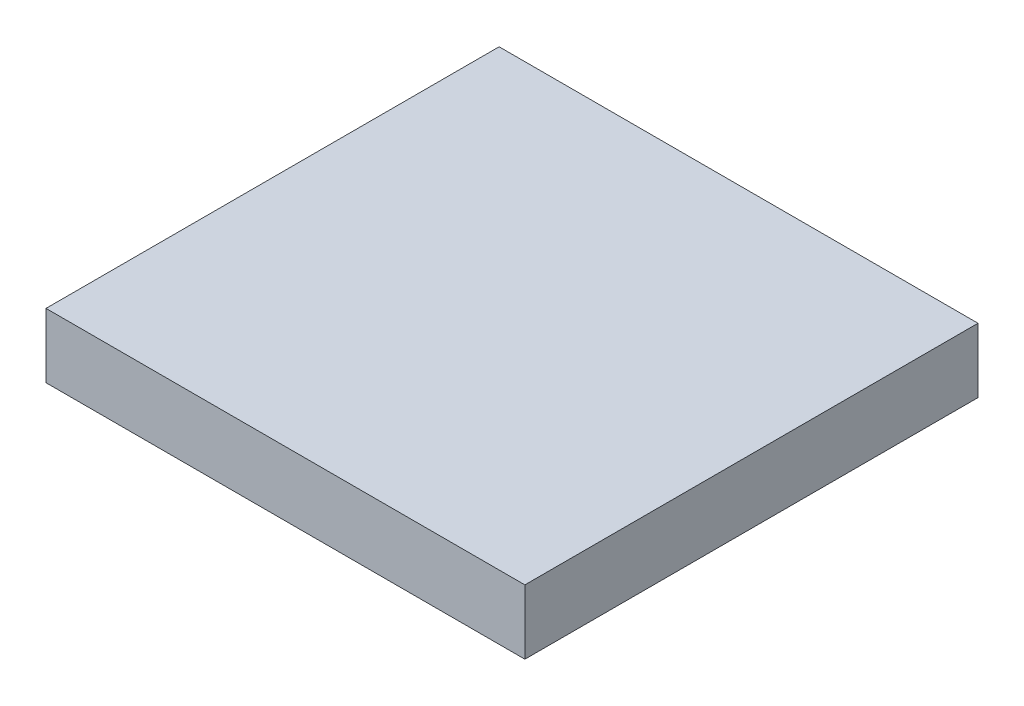
ISO-10303-21;
HEADER;
FILE_DESCRIPTION(('STEP AP214'),'2;1');
FILE_NAME('part.step','',(''),(''),'','','');
FILE_SCHEMA(('AUTOMOTIVE_DESIGN { 1 0 10303 214 1 1 1 1 }'));
ENDSEC;
DATA;
#1=APPLICATION_CONTEXT('core data for automotive mechanical design processes');
#2=APPLICATION_PROTOCOL_DEFINITION('international standard','automotive_design',2000,#1);
#3=PRODUCT_CONTEXT('',#1,'mechanical');
#4=PRODUCT('Part','Part','',(#3));
#5=PRODUCT_RELATED_PRODUCT_CATEGORY('part','',(#4));
#6=PRODUCT_DEFINITION_FORMATION('','',#4);
#7=PRODUCT_DEFINITION_CONTEXT('part definition',#1,'design');
#8=PRODUCT_DEFINITION('design','',#6,#7);
#9=PRODUCT_DEFINITION_SHAPE('','',#8);
#10=(LENGTH_UNIT() NAMED_UNIT(*) SI_UNIT(.MILLI.,.METRE.));
#11=(NAMED_UNIT(*) PLANE_ANGLE_UNIT() SI_UNIT($,.RADIAN.));
#12=(NAMED_UNIT(*) SI_UNIT($,.STERADIAN.) SOLID_ANGLE_UNIT());
#13=UNCERTAINTY_MEASURE_WITH_UNIT(LENGTH_MEASURE(1.E-05),#10,'distance_accuracy_value','');
#14=(GEOMETRIC_REPRESENTATION_CONTEXT(3) GLOBAL_UNCERTAINTY_ASSIGNED_CONTEXT((#13)) GLOBAL_UNIT_ASSIGNED_CONTEXT((#10,
#11,#12)) REPRESENTATION_CONTEXT('',''));
#15=CARTESIAN_POINT('',(0.,0.,0.));
#16=DIRECTION('',(0.,0.,1.));
#17=DIRECTION('',(1.,0.,0.));
#18=AXIS2_PLACEMENT_3D('',#15,#16,#17);
#19=CARTESIAN_POINT('',(0.,-10.,0.));
#20=DIRECTION('',(0.,-1.,0.));
#21=DIRECTION('',(0.,0.,-1.));
#22=AXIS2_PLACEMENT_3D('',#19,#20,#21);
#23=PLANE('',#22);
#24=DIRECTION('',(0.,0.,1.));
#25=VECTOR('',#24,1.);
#26=CARTESIAN_POINT('',(-7.17455064928218,-10.,10.1745506492822));
#27=LINE('',#26,#25);
#28=CARTESIAN_POINT('',(-7.17455064928219,-10.,-60.1745506492822));
#29=VERTEX_POINT('',#28);
#30=CARTESIAN_POINT('',(-7.17455064928218,-10.,10.1745506492822));
#31=VERTEX_POINT('',#30);
#32=EDGE_CURVE('E91',#29,#31,#27,.T.);
#33=ORIENTED_EDGE('',*,*,#32,.F.);
#34=DIRECTION('',(-1.,0.,0.));
#35=VECTOR('',#34,1.);
#36=CARTESIAN_POINT('',(-7.17455064928219,-10.,-60.1745506492822));
#37=LINE('',#36,#35);
#38=CARTESIAN_POINT('',(67.1745506492822,-10.,-60.1745506492822));
#39=VERTEX_POINT('',#38);
#40=EDGE_CURVE('E86',#39,#29,#37,.T.);
#41=ORIENTED_EDGE('',*,*,#40,.F.);
#42=DIRECTION('',(0.,0.,-1.));
#43=VECTOR('',#42,1.);
#44=CARTESIAN_POINT('',(67.1745506492822,-10.,10.1745506492822));
#45=LINE('',#44,#43);
#46=CARTESIAN_POINT('',(67.1745506492822,-10.,10.1745506492822));
#47=VERTEX_POINT('',#46);
#48=EDGE_CURVE('E94',#47,#39,#45,.T.);
#49=ORIENTED_EDGE('',*,*,#48,.F.);
#50=DIRECTION('',(1.,0.,0.));
#51=VECTOR('',#50,1.);
#52=CARTESIAN_POINT('',(-7.17455064928218,-10.,10.1745506492822));
#53=LINE('',#52,#51);
#54=EDGE_CURVE('E81',#31,#47,#53,.T.);
#55=ORIENTED_EDGE('',*,*,#54,.F.);
#56=EDGE_LOOP('',(#33,#41,#49,#55));
#57=FACE_BOUND('',#56,.T.);
#58=ADVANCED_FACE('F39',(#57),#23,.T.);
#59=CARTESIAN_POINT('',(-7.17455064928218,-10.,10.1745506492822));
#60=DIRECTION('',(0.,0.,1.));
#61=DIRECTION('',(1.,0.,0.));
#62=AXIS2_PLACEMENT_3D('',#59,#60,#61);
#63=PLANE('',#62);
#64=DIRECTION('',(0.,1.,0.));
#65=VECTOR('',#64,1.);
#66=CARTESIAN_POINT('',(67.1745506492822,-10.,10.1745506492822));
#67=LINE('',#66,#65);
#68=CARTESIAN_POINT('',(67.1745506492822,0.,10.1745506492822));
#69=VERTEX_POINT('',#68);
#70=EDGE_CURVE('E85',#47,#69,#67,.T.);
#71=ORIENTED_EDGE('',*,*,#70,.T.);
#72=DIRECTION('',(-1.,0.,0.));
#73=VECTOR('',#72,1.);
#74=CARTESIAN_POINT('',(-7.17455064928218,0.,10.1745506492822));
#75=LINE('',#74,#73);
#76=CARTESIAN_POINT('',(-7.17455064928218,0.,10.1745506492822));
#77=VERTEX_POINT('',#76);
#78=EDGE_CURVE('E43',#69,#77,#75,.T.);
#79=ORIENTED_EDGE('',*,*,#78,.T.);
#80=DIRECTION('',(0.,1.,0.));
#81=VECTOR('',#80,1.);
#82=CARTESIAN_POINT('',(-7.17455064928218,-10.,10.1745506492822));
#83=LINE('',#82,#81);
#84=EDGE_CURVE('E77',#31,#77,#83,.T.);
#85=ORIENTED_EDGE('',*,*,#84,.F.);
#86=ORIENTED_EDGE('',*,*,#54,.T.);
#87=EDGE_LOOP('',(#71,#79,#85,#86));
#88=FACE_BOUND('',#87,.T.);
#89=ADVANCED_FACE('F80',(#88),#63,.T.);
#90=CARTESIAN_POINT('',(67.1745506492822,-10.,10.1745506492822));
#91=DIRECTION('',(1.,0.,0.));
#92=DIRECTION('',(0.,0.,-1.));
#93=AXIS2_PLACEMENT_3D('',#90,#91,#92);
#94=PLANE('',#93);
#95=DIRECTION('',(0.,1.,0.));
#96=VECTOR('',#95,1.);
#97=CARTESIAN_POINT('',(67.1745506492822,-10.,-60.1745506492822));
#98=LINE('',#97,#96);
#99=CARTESIAN_POINT('',(67.1745506492822,0.,-60.1745506492822));
#100=VERTEX_POINT('',#99);
#101=EDGE_CURVE('E106',#39,#100,#98,.T.);
#102=ORIENTED_EDGE('',*,*,#101,.T.);
#103=DIRECTION('',(0.,0.,1.));
#104=VECTOR('',#103,1.);
#105=CARTESIAN_POINT('',(67.1745506492822,0.,10.1745506492822));
#106=LINE('',#105,#104);
#107=EDGE_CURVE('E11',#100,#69,#106,.T.);
#108=ORIENTED_EDGE('',*,*,#107,.T.);
#109=ORIENTED_EDGE('',*,*,#70,.F.);
#110=ORIENTED_EDGE('',*,*,#48,.T.);
#111=EDGE_LOOP('',(#102,#108,#109,#110));
#112=FACE_BOUND('',#111,.T.);
#113=ADVANCED_FACE('F109',(#112),#94,.T.);
#114=CARTESIAN_POINT('',(-7.17455064928219,-10.,-60.1745506492822));
#115=DIRECTION('',(0.,0.,-1.));
#116=DIRECTION('',(-1.,0.,0.));
#117=AXIS2_PLACEMENT_3D('',#114,#115,#116);
#118=PLANE('',#117);
#119=DIRECTION('',(0.,1.,0.));
#120=VECTOR('',#119,1.);
#121=CARTESIAN_POINT('',(-7.17455064928219,-10.,-60.1745506492822));
#122=LINE('',#121,#120);
#123=CARTESIAN_POINT('',(-7.17455064928219,0.,-60.1745506492822));
#124=VERTEX_POINT('',#123);
#125=EDGE_CURVE('E97',#29,#124,#122,.T.);
#126=ORIENTED_EDGE('',*,*,#125,.T.);
#127=DIRECTION('',(1.,0.,0.));
#128=VECTOR('',#127,1.);
#129=CARTESIAN_POINT('',(-7.17455064928219,0.,-60.1745506492822));
#130=LINE('',#129,#128);
#131=EDGE_CURVE('E48',#124,#100,#130,.T.);
#132=ORIENTED_EDGE('',*,*,#131,.T.);
#133=ORIENTED_EDGE('',*,*,#101,.F.);
#134=ORIENTED_EDGE('',*,*,#40,.T.);
#135=EDGE_LOOP('',(#126,#132,#133,#134));
#136=FACE_BOUND('',#135,.T.);
#137=ADVANCED_FACE('F112',(#136),#118,.T.);
#138=CARTESIAN_POINT('',(-7.17455064928218,-10.,10.1745506492822));
#139=DIRECTION('',(-1.,0.,0.));
#140=DIRECTION('',(0.,0.,1.));
#141=AXIS2_PLACEMENT_3D('',#138,#139,#140);
#142=PLANE('',#141);
#143=ORIENTED_EDGE('',*,*,#84,.T.);
#144=DIRECTION('',(0.,0.,-1.));
#145=VECTOR('',#144,1.);
#146=CARTESIAN_POINT('',(-7.17455064928218,0.,10.1745506492822));
#147=LINE('',#146,#145);
#148=EDGE_CURVE('E100',#77,#124,#147,.T.);
#149=ORIENTED_EDGE('',*,*,#148,.T.);
#150=ORIENTED_EDGE('',*,*,#125,.F.);
#151=ORIENTED_EDGE('',*,*,#32,.T.);
#152=EDGE_LOOP('',(#143,#149,#150,#151));
#153=FACE_BOUND('',#152,.T.);
#154=ADVANCED_FACE('F41',(#153),#142,.T.);
#155=CARTESIAN_POINT('',(0.,0.,0.));
#156=DIRECTION('',(0.,-1.,0.));
#157=DIRECTION('',(0.,0.,-1.));
#158=AXIS2_PLACEMENT_3D('',#155,#156,#157);
#159=PLANE('',#158);
#160=ORIENTED_EDGE('',*,*,#78,.F.);
#161=ORIENTED_EDGE('',*,*,#107,.F.);
#162=ORIENTED_EDGE('',*,*,#131,.F.);
#163=ORIENTED_EDGE('',*,*,#148,.F.);
#164=EDGE_LOOP('',(#160,#161,#162,#163));
#165=FACE_BOUND('',#164,.T.);
#166=ADVANCED_FACE('F113',(#165),#159,.F.);
#167=CLOSED_SHELL('',(#58,#89,#113,#137,#154,#166));
#168=MANIFOLD_SOLID_BREP('B2',#167);
#169=ADVANCED_BREP_SHAPE_REPRESENTATION('',(#18,#168),#14);
#170=SHAPE_DEFINITION_REPRESENTATION(#9,#169);
ENDSEC;
END-ISO-10303-21;
